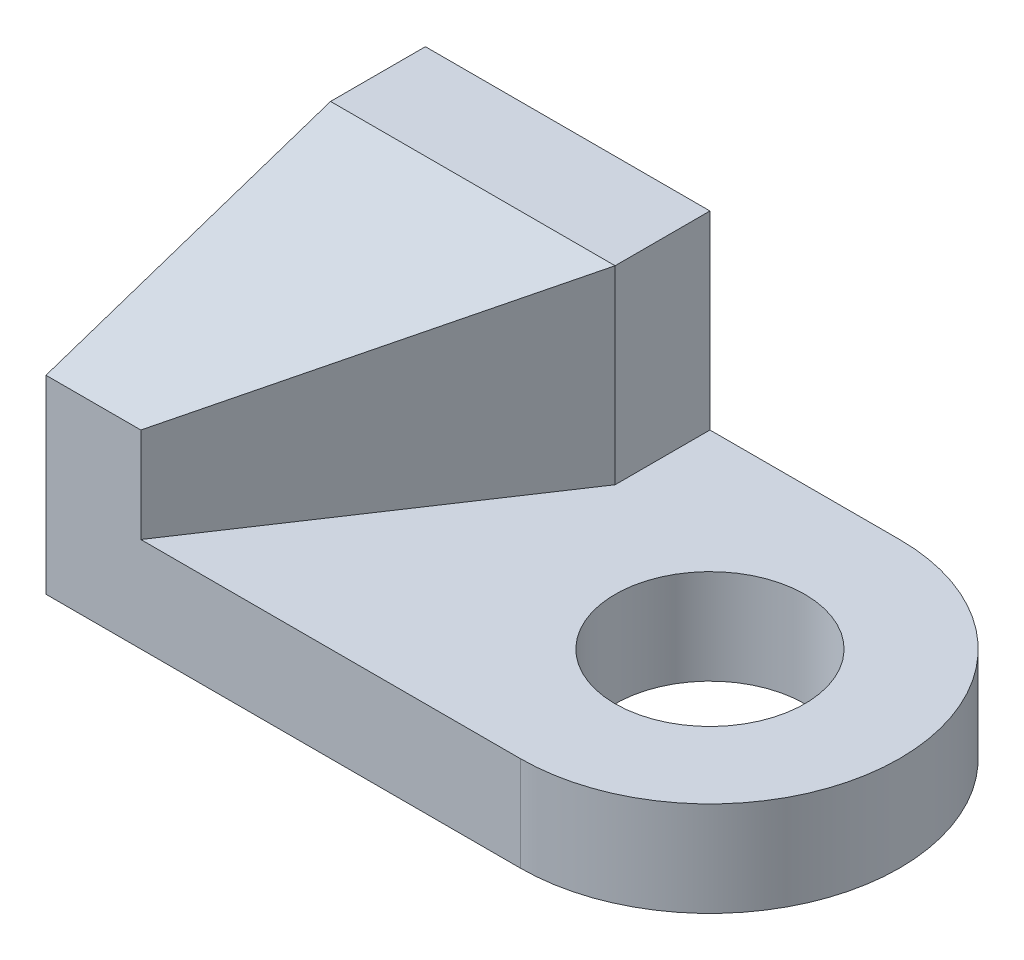
ISO-10303-21;
HEADER;
FILE_DESCRIPTION(('STEP AP214'),'2;1');
FILE_NAME('part.step','',(''),(''),'','','');
FILE_SCHEMA(('AUTOMOTIVE_DESIGN { 1 0 10303 214 1 1 1 1 }'));
ENDSEC;
DATA;
#1=APPLICATION_CONTEXT('core data for automotive mechanical design processes');
#2=APPLICATION_PROTOCOL_DEFINITION('international standard','automotive_design',2000,#1);
#3=PRODUCT_CONTEXT('',#1,'mechanical');
#4=PRODUCT('Part','Part','',(#3));
#5=PRODUCT_RELATED_PRODUCT_CATEGORY('part','',(#4));
#6=PRODUCT_DEFINITION_FORMATION('','',#4);
#7=PRODUCT_DEFINITION_CONTEXT('part definition',#1,'design');
#8=PRODUCT_DEFINITION('design','',#6,#7);
#9=PRODUCT_DEFINITION_SHAPE('','',#8);
#10=(LENGTH_UNIT() NAMED_UNIT(*) SI_UNIT(.MILLI.,.METRE.));
#11=(NAMED_UNIT(*) PLANE_ANGLE_UNIT() SI_UNIT($,.RADIAN.));
#12=(NAMED_UNIT(*) SI_UNIT($,.STERADIAN.) SOLID_ANGLE_UNIT());
#13=UNCERTAINTY_MEASURE_WITH_UNIT(LENGTH_MEASURE(1.E-05),#10,'distance_accuracy_value','');
#14=(GEOMETRIC_REPRESENTATION_CONTEXT(3) GLOBAL_UNCERTAINTY_ASSIGNED_CONTEXT((#13)) GLOBAL_UNIT_ASSIGNED_CONTEXT((#10,
#11,#12)) REPRESENTATION_CONTEXT('',''));
#15=CARTESIAN_POINT('',(0.,0.,0.));
#16=DIRECTION('',(0.,0.,1.));
#17=DIRECTION('',(1.,0.,0.));
#18=AXIS2_PLACEMENT_3D('',#15,#16,#17);
#19=CARTESIAN_POINT('',(-10.6017024282411,5.22558114441514,1.17187678347344));
#20=DIRECTION('',(0.,0.,-1.));
#21=DIRECTION('',(-1.,0.,0.));
#22=AXIS2_PLACEMENT_3D('',#19,#20,#21);
#23=PLANE('',#22);
#24=DIRECTION('',(1.,0.,0.));
#25=VECTOR('',#24,1.);
#26=CARTESIAN_POINT('',(-10.6017024282411,5.22558114441514,1.17187678347344));
#27=LINE('',#26,#25);
#28=CARTESIAN_POINT('',(-14.6017024282411,5.22558114441514,1.17187678347344));
#29=VERTEX_POINT('',#28);
#30=CARTESIAN_POINT('',(-10.6017024282411,5.22558114441514,1.17187678347344));
#31=VERTEX_POINT('',#30);
#32=EDGE_CURVE('E103',#29,#31,#27,.T.);
#33=ORIENTED_EDGE('',*,*,#32,.F.);
#34=DIRECTION('',(0.,1.,0.));
#35=VECTOR('',#34,1.);
#36=CARTESIAN_POINT('',(-14.6017024282411,5.22558114441514,1.17187678347344));
#37=LINE('',#36,#35);
#38=CARTESIAN_POINT('',(-14.6017024282411,6.22558114441514,1.17187678347344));
#39=VERTEX_POINT('',#38);
#40=EDGE_CURVE('E141',#29,#39,#37,.T.);
#41=ORIENTED_EDGE('',*,*,#40,.T.);
#42=DIRECTION('',(1.,0.,0.));
#43=VECTOR('',#42,1.);
#44=CARTESIAN_POINT('',(-15.6017024282411,6.22558114441514,1.17187678347344));
#45=LINE('',#44,#43);
#46=CARTESIAN_POINT('',(-15.6017024282411,6.22558114441514,1.17187678347344));
#47=VERTEX_POINT('',#46);
#48=EDGE_CURVE('E133',#47,#39,#45,.T.);
#49=ORIENTED_EDGE('',*,*,#48,.F.);
#50=DIRECTION('',(0.,-1.,0.));
#51=VECTOR('',#50,1.);
#52=CARTESIAN_POINT('',(-15.6017024282411,7.22558114441514,1.17187678347344));
#53=LINE('',#52,#51);
#54=CARTESIAN_POINT('',(-15.6017024282411,4.22558114441514,1.17187678347344));
#55=VERTEX_POINT('',#54);
#56=EDGE_CURVE('E119',#47,#55,#53,.T.);
#57=ORIENTED_EDGE('',*,*,#56,.T.);
#58=DIRECTION('',(1.,0.,0.));
#59=VECTOR('',#58,1.);
#60=CARTESIAN_POINT('',(-10.6017024282411,4.22558114441514,1.17187678347344));
#61=LINE('',#60,#59);
#62=CARTESIAN_POINT('',(-10.6017024282411,4.22558114441514,1.17187678347344));
#63=VERTEX_POINT('',#62);
#64=EDGE_CURVE('E84',#55,#63,#61,.T.);
#65=ORIENTED_EDGE('',*,*,#64,.T.);
#66=DIRECTION('',(0.,-1.,0.));
#67=VECTOR('',#66,1.);
#68=CARTESIAN_POINT('',(-10.6017024282411,5.22558114441514,1.17187678347344));
#69=LINE('',#68,#67);
#70=EDGE_CURVE('E46',#31,#63,#69,.T.);
#71=ORIENTED_EDGE('',*,*,#70,.F.);
#72=EDGE_LOOP('',(#33,#41,#49,#57,#65,#71));
#73=FACE_BOUND('',#72,.T.);
#74=ADVANCED_FACE('F38',(#73),#23,.F.);
#75=CARTESIAN_POINT('',(-10.6017024282411,5.22558114441514,-0.828123216526564));
#76=DIRECTION('',(0.,-1.,0.));
#77=DIRECTION('',(0.,0.,-1.));
#78=AXIS2_PLACEMENT_3D('',#75,#76,#77);
#79=CYLINDRICAL_SURFACE('',#78,2.);
#80=CARTESIAN_POINT('',(-10.6017024282411,4.22558114441514,-0.828123216526564));
#81=DIRECTION('',(0.,1.,0.));
#82=DIRECTION('',(0.,0.,1.));
#83=AXIS2_PLACEMENT_3D('',#80,#81,#82);
#84=CIRCLE('',#83,2.);
#85=CARTESIAN_POINT('',(-10.6017024282411,4.22558114441514,-2.82812321652656));
#86=VERTEX_POINT('',#85);
#87=EDGE_CURVE('E73',#63,#86,#84,.T.);
#88=ORIENTED_EDGE('',*,*,#87,.T.);
#89=DIRECTION('',(0.,-1.,0.));
#90=VECTOR('',#89,1.);
#91=CARTESIAN_POINT('',(-10.6017024282411,5.22558114441514,-2.82812321652656));
#92=LINE('',#91,#90);
#93=CARTESIAN_POINT('',(-10.6017024282411,5.22558114441514,-2.82812321652656));
#94=VERTEX_POINT('',#93);
#95=EDGE_CURVE('E76',#94,#86,#92,.T.);
#96=ORIENTED_EDGE('',*,*,#95,.F.);
#97=CARTESIAN_POINT('',(-10.6017024282411,5.22558114441514,-0.828123216526564));
#98=DIRECTION('',(0.,1.,0.));
#99=DIRECTION('',(0.,0.,1.));
#100=AXIS2_PLACEMENT_3D('',#97,#98,#99);
#101=CIRCLE('',#100,2.);
#102=EDGE_CURVE('E61',#31,#94,#101,.T.);
#103=ORIENTED_EDGE('',*,*,#102,.F.);
#104=ORIENTED_EDGE('',*,*,#70,.T.);
#105=EDGE_LOOP('',(#88,#96,#103,#104));
#106=FACE_BOUND('',#105,.T.);
#107=ADVANCED_FACE('F75',(#106),#79,.T.);
#108=CARTESIAN_POINT('',(-10.6017024282411,5.22558114441514,-2.82812321652656));
#109=DIRECTION('',(0.,0.,1.));
#110=DIRECTION('',(1.,0.,0.));
#111=AXIS2_PLACEMENT_3D('',#108,#109,#110);
#112=PLANE('',#111);
#113=DIRECTION('',(-1.,0.,0.));
#114=VECTOR('',#113,1.);
#115=CARTESIAN_POINT('',(-10.6017024282411,4.22558114441514,-2.82812321652656));
#116=LINE('',#115,#114);
#117=CARTESIAN_POINT('',(-15.6017024282411,4.22558114441514,-2.82812321652656));
#118=VERTEX_POINT('',#117);
#119=EDGE_CURVE('E83',#86,#118,#116,.T.);
#120=ORIENTED_EDGE('',*,*,#119,.T.);
#121=DIRECTION('',(0.,-1.,0.));
#122=VECTOR('',#121,1.);
#123=CARTESIAN_POINT('',(-15.6017024282411,7.22558114441514,-2.82812321652656));
#124=LINE('',#123,#122);
#125=CARTESIAN_POINT('',(-15.6017024282411,7.22558114441514,-2.82812321652656));
#126=VERTEX_POINT('',#125);
#127=EDGE_CURVE('E117',#126,#118,#124,.T.);
#128=ORIENTED_EDGE('',*,*,#127,.F.);
#129=DIRECTION('',(-1.,0.,0.));
#130=VECTOR('',#129,1.);
#131=CARTESIAN_POINT('',(-10.6017024282411,7.22558114441514,-2.82812321652656));
#132=LINE('',#131,#130);
#133=CARTESIAN_POINT('',(-12.6017024282411,7.22558114441514,-2.82812321652656));
#134=VERTEX_POINT('',#133);
#135=EDGE_CURVE('E128',#134,#126,#132,.T.);
#136=ORIENTED_EDGE('',*,*,#135,.F.);
#137=DIRECTION('',(0.,-1.,0.));
#138=VECTOR('',#137,1.);
#139=CARTESIAN_POINT('',(-12.6017024282411,7.22558114441514,-2.82812321652656));
#140=LINE('',#139,#138);
#141=CARTESIAN_POINT('',(-12.6017024282411,5.22558114441514,-2.82812321652656));
#142=VERTEX_POINT('',#141);
#143=EDGE_CURVE('E110',#134,#142,#140,.T.);
#144=ORIENTED_EDGE('',*,*,#143,.T.);
#145=DIRECTION('',(-1.,0.,0.));
#146=VECTOR('',#145,1.);
#147=CARTESIAN_POINT('',(-10.6017024282411,5.22558114441514,-2.82812321652656));
#148=LINE('',#147,#146);
#149=EDGE_CURVE('E93',#94,#142,#148,.T.);
#150=ORIENTED_EDGE('',*,*,#149,.F.);
#151=ORIENTED_EDGE('',*,*,#95,.T.);
#152=EDGE_LOOP('',(#120,#128,#136,#144,#150,#151));
#153=FACE_BOUND('',#152,.T.);
#154=ADVANCED_FACE('F88',(#153),#112,.F.);
#155=CARTESIAN_POINT('',(-10.6017024282411,5.22558114441514,-0.828123216526564));
#156=DIRECTION('',(0.,-1.,0.));
#157=DIRECTION('',(0.,0.,-1.));
#158=AXIS2_PLACEMENT_3D('',#155,#156,#157);
#159=CYLINDRICAL_SURFACE('',#158,1.);
#160=CARTESIAN_POINT('',(-10.6017024282411,5.22558114441514,-0.828123216526564));
#161=DIRECTION('',(0.,1.,0.));
#162=DIRECTION('',(0.,0.,1.));
#163=AXIS2_PLACEMENT_3D('',#160,#161,#162);
#164=CIRCLE('',#163,1.);
#165=CARTESIAN_POINT('',(-10.6017024282411,5.22558114441514,0.171876783473436));
#166=VERTEX_POINT('',#165);
#167=EDGE_CURVE('E100',#166,#166,#164,.T.);
#168=ORIENTED_EDGE('',*,*,#167,.T.);
#169=EDGE_LOOP('',(#168));
#170=FACE_BOUND('',#169,.T.);
#171=CARTESIAN_POINT('',(-10.6017024282411,4.22558114441514,-0.828123216526564));
#172=DIRECTION('',(0.,1.,0.));
#173=DIRECTION('',(0.,0.,1.));
#174=AXIS2_PLACEMENT_3D('',#171,#172,#173);
#175=CIRCLE('',#174,1.);
#176=CARTESIAN_POINT('',(-10.6017024282411,4.22558114441514,0.171876783473436));
#177=VERTEX_POINT('',#176);
#178=EDGE_CURVE('E107',#177,#177,#175,.T.);
#179=ORIENTED_EDGE('',*,*,#178,.F.);
#180=EDGE_LOOP('',(#179));
#181=FACE_BOUND('',#180,.T.);
#182=ADVANCED_FACE('F40',(#170,#181),#159,.F.);
#183=CARTESIAN_POINT('',(-10.6017024282411,5.22558114441514,-0.828123216526564));
#184=DIRECTION('',(0.,1.,0.));
#185=DIRECTION('',(0.,0.,1.));
#186=AXIS2_PLACEMENT_3D('',#183,#184,#185);
#187=PLANE('',#186);
#188=ORIENTED_EDGE('',*,*,#167,.F.);
#189=EDGE_LOOP('',(#188));
#190=FACE_BOUND('',#189,.T.);
#191=ORIENTED_EDGE('',*,*,#32,.T.);
#192=ORIENTED_EDGE('',*,*,#102,.T.);
#193=ORIENTED_EDGE('',*,*,#149,.T.);
#194=DIRECTION('',(0.,0.,1.));
#195=VECTOR('',#194,1.);
#196=CARTESIAN_POINT('',(-12.6017024282411,5.22558114441514,-0.828123216526564));
#197=LINE('',#196,#195);
#198=CARTESIAN_POINT('',(-12.6017024282411,5.22558114441514,-1.82812321652656));
#199=VERTEX_POINT('',#198);
#200=EDGE_CURVE('E94',#142,#199,#197,.T.);
#201=ORIENTED_EDGE('',*,*,#200,.T.);
#202=DIRECTION('',(-0.554700196225229,0.,0.832050294337844));
#203=VECTOR('',#202,1.);
#204=CARTESIAN_POINT('',(-12.6017024282411,5.22558114441514,-1.82812321652656));
#205=LINE('',#204,#203);
#206=EDGE_CURVE('E143',#199,#29,#205,.T.);
#207=ORIENTED_EDGE('',*,*,#206,.T.);
#208=EDGE_LOOP('',(#191,#192,#193,#201,#207));
#209=FACE_BOUND('',#208,.T.);
#210=ADVANCED_FACE('F148',(#190,#209),#187,.T.);
#211=CARTESIAN_POINT('',(-10.6017024282411,4.22558114441514,-0.828123216526564));
#212=DIRECTION('',(0.,1.,0.));
#213=DIRECTION('',(0.,0.,1.));
#214=AXIS2_PLACEMENT_3D('',#211,#212,#213);
#215=PLANE('',#214);
#216=ORIENTED_EDGE('',*,*,#178,.T.);
#217=EDGE_LOOP('',(#216));
#218=FACE_BOUND('',#217,.T.);
#219=ORIENTED_EDGE('',*,*,#64,.F.);
#220=DIRECTION('',(0.,0.,1.));
#221=VECTOR('',#220,1.);
#222=CARTESIAN_POINT('',(-15.6017024282411,4.22558114441514,-0.828123216526564));
#223=LINE('',#222,#221);
#224=EDGE_CURVE('E99',#118,#55,#223,.T.);
#225=ORIENTED_EDGE('',*,*,#224,.F.);
#226=ORIENTED_EDGE('',*,*,#119,.F.);
#227=ORIENTED_EDGE('',*,*,#87,.F.);
#228=EDGE_LOOP('',(#219,#225,#226,#227));
#229=FACE_BOUND('',#228,.T.);
#230=ADVANCED_FACE('F97',(#218,#229),#215,.F.);
#231=CARTESIAN_POINT('',(-12.6017024282411,7.22558114441514,-0.828123216526564));
#232=DIRECTION('',(1.,0.,0.));
#233=DIRECTION('',(0.,0.,-1.));
#234=AXIS2_PLACEMENT_3D('',#231,#232,#233);
#235=PLANE('',#234);
#236=DIRECTION('',(0.,1.,0.));
#237=VECTOR('',#236,1.);
#238=CARTESIAN_POINT('',(-12.6017024282411,5.22558114441514,-1.82812321652656));
#239=LINE('',#238,#237);
#240=CARTESIAN_POINT('',(-12.6017024282411,7.22558114441514,-1.82812321652656));
#241=VERTEX_POINT('',#240);
#242=EDGE_CURVE('E53',#199,#241,#239,.T.);
#243=ORIENTED_EDGE('',*,*,#242,.F.);
#244=ORIENTED_EDGE('',*,*,#200,.F.);
#245=ORIENTED_EDGE('',*,*,#143,.F.);
#246=DIRECTION('',(0.,0.,1.));
#247=VECTOR('',#246,1.);
#248=CARTESIAN_POINT('',(-12.6017024282411,7.22558114441514,-0.828123216526564));
#249=LINE('',#248,#247);
#250=EDGE_CURVE('E124',#134,#241,#249,.T.);
#251=ORIENTED_EDGE('',*,*,#250,.T.);
#252=EDGE_LOOP('',(#243,#244,#245,#251));
#253=FACE_BOUND('',#252,.T.);
#254=ADVANCED_FACE('F158',(#253),#235,.T.);
#255=CARTESIAN_POINT('',(-15.6017024282411,7.22558114441514,-0.828123216526564));
#256=DIRECTION('',(1.,0.,0.));
#257=DIRECTION('',(0.,0.,-1.));
#258=AXIS2_PLACEMENT_3D('',#255,#256,#257);
#259=PLANE('',#258);
#260=ORIENTED_EDGE('',*,*,#56,.F.);
#261=DIRECTION('',(0.,0.316227766016838,-0.948683298050514));
#262=VECTOR('',#261,1.);
#263=CARTESIAN_POINT('',(-15.6017024282411,7.22558114441514,-1.82812321652656));
#264=LINE('',#263,#262);
#265=CARTESIAN_POINT('',(-15.6017024282411,7.22558114441514,-1.82812321652656));
#266=VERTEX_POINT('',#265);
#267=EDGE_CURVE('E136',#47,#266,#264,.T.);
#268=ORIENTED_EDGE('',*,*,#267,.T.);
#269=DIRECTION('',(0.,0.,1.));
#270=VECTOR('',#269,1.);
#271=CARTESIAN_POINT('',(-15.6017024282411,7.22558114441514,-0.828123216526564));
#272=LINE('',#271,#270);
#273=EDGE_CURVE('E122',#126,#266,#272,.T.);
#274=ORIENTED_EDGE('',*,*,#273,.F.);
#275=ORIENTED_EDGE('',*,*,#127,.T.);
#276=ORIENTED_EDGE('',*,*,#224,.T.);
#277=EDGE_LOOP('',(#260,#268,#274,#275,#276));
#278=FACE_BOUND('',#277,.T.);
#279=ADVANCED_FACE('F190',(#278),#259,.F.);
#280=CARTESIAN_POINT('',(-10.6017024282411,7.22558114441514,-0.828123216526564));
#281=DIRECTION('',(0.,1.,0.));
#282=DIRECTION('',(0.,0.,1.));
#283=AXIS2_PLACEMENT_3D('',#280,#281,#282);
#284=PLANE('',#283);
#285=DIRECTION('',(1.,0.,0.));
#286=VECTOR('',#285,1.);
#287=CARTESIAN_POINT('',(-15.6017024282411,7.22558114441514,-1.82812321652656));
#288=LINE('',#287,#286);
#289=EDGE_CURVE('E125',#266,#241,#288,.T.);
#290=ORIENTED_EDGE('',*,*,#289,.T.);
#291=ORIENTED_EDGE('',*,*,#250,.F.);
#292=ORIENTED_EDGE('',*,*,#135,.T.);
#293=ORIENTED_EDGE('',*,*,#273,.T.);
#294=EDGE_LOOP('',(#290,#291,#292,#293));
#295=FACE_BOUND('',#294,.T.);
#296=ADVANCED_FACE('F164',(#295),#284,.T.);
#297=CARTESIAN_POINT('',(-15.6017024282411,7.22558114441514,-1.82812321652656));
#298=DIRECTION('',(0.,-0.948683298050514,-0.316227766016838));
#299=DIRECTION('',(0.,0.316227766016838,-0.948683298050514));
#300=AXIS2_PLACEMENT_3D('',#297,#298,#299);
#301=PLANE('',#300);
#302=ORIENTED_EDGE('',*,*,#48,.T.);
#303=DIRECTION('',(0.534522483824849,0.267261241912424,-0.801783725737273));
#304=VECTOR('',#303,1.);
#305=CARTESIAN_POINT('',(-13.458845285384,6.79700971584371,-0.542408930812278));
#306=LINE('',#305,#304);
#307=EDGE_CURVE('E11',#39,#241,#306,.T.);
#308=ORIENTED_EDGE('',*,*,#307,.T.);
#309=ORIENTED_EDGE('',*,*,#289,.F.);
#310=ORIENTED_EDGE('',*,*,#267,.F.);
#311=EDGE_LOOP('',(#302,#308,#309,#310));
#312=FACE_BOUND('',#311,.T.);
#313=ADVANCED_FACE('F182',(#312),#301,.F.);
#314=CARTESIAN_POINT('',(-12.6017024282411,5.22558114441514,-1.82812321652656));
#315=DIRECTION('',(-0.832050294337844,0.,-0.554700196225229));
#316=DIRECTION('',(-0.554700196225229,0.,0.832050294337844));
#317=AXIS2_PLACEMENT_3D('',#314,#315,#316);
#318=PLANE('',#317);
#319=ORIENTED_EDGE('',*,*,#40,.F.);
#320=ORIENTED_EDGE('',*,*,#206,.F.);
#321=ORIENTED_EDGE('',*,*,#242,.T.);
#322=ORIENTED_EDGE('',*,*,#307,.F.);
#323=EDGE_LOOP('',(#319,#320,#321,#322));
#324=FACE_BOUND('',#323,.T.);
#325=ADVANCED_FACE('F155',(#324),#318,.F.);
#326=CLOSED_SHELL('',(#74,#107,#154,#182,#210,#230,#254,#279,#296,#313,#325));
#327=MANIFOLD_SOLID_BREP('B2',#326);
#328=ADVANCED_BREP_SHAPE_REPRESENTATION('',(#18,#327),#14);
#329=SHAPE_DEFINITION_REPRESENTATION(#9,#328);
ENDSEC;
END-ISO-10303-21;
